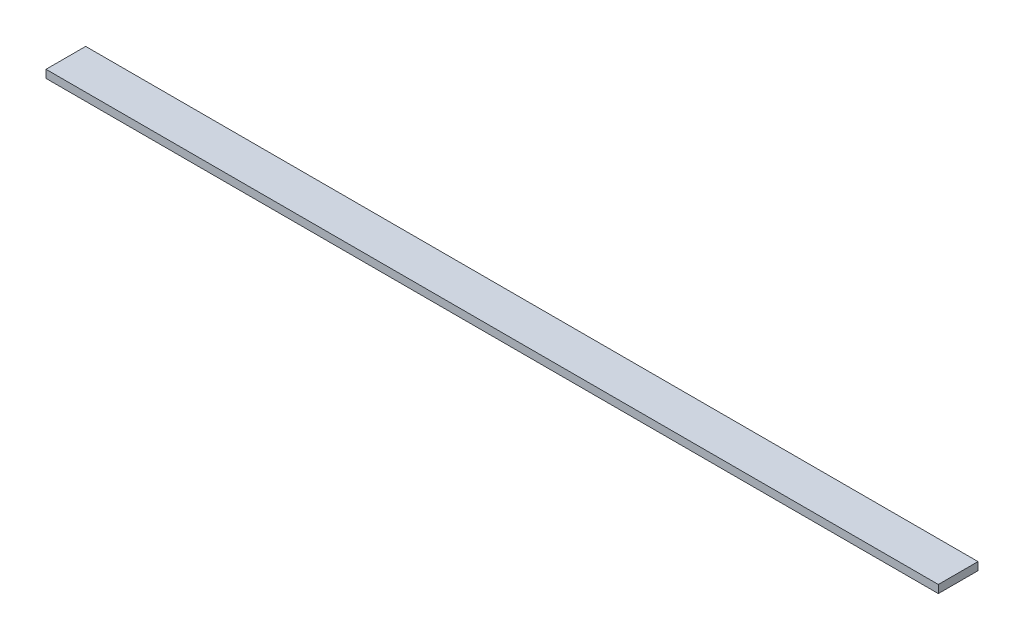
ISO-10303-21;
HEADER;
FILE_DESCRIPTION(('STEP AP214'),'2;1');
FILE_NAME('part.step','',(''),(''),'','','');
FILE_SCHEMA(('AUTOMOTIVE_DESIGN { 1 0 10303 214 1 1 1 1 }'));
ENDSEC;
DATA;
#1=APPLICATION_CONTEXT('core data for automotive mechanical design processes');
#2=APPLICATION_PROTOCOL_DEFINITION('international standard','automotive_design',2000,#1);
#3=PRODUCT_CONTEXT('',#1,'mechanical');
#4=PRODUCT('Part','Part','',(#3));
#5=PRODUCT_RELATED_PRODUCT_CATEGORY('part','',(#4));
#6=PRODUCT_DEFINITION_FORMATION('','',#4);
#7=PRODUCT_DEFINITION_CONTEXT('part definition',#1,'design');
#8=PRODUCT_DEFINITION('design','',#6,#7);
#9=PRODUCT_DEFINITION_SHAPE('','',#8);
#10=(LENGTH_UNIT() NAMED_UNIT(*) SI_UNIT(.MILLI.,.METRE.));
#11=(NAMED_UNIT(*) PLANE_ANGLE_UNIT() SI_UNIT($,.RADIAN.));
#12=(NAMED_UNIT(*) SI_UNIT($,.STERADIAN.) SOLID_ANGLE_UNIT());
#13=UNCERTAINTY_MEASURE_WITH_UNIT(LENGTH_MEASURE(1.E-05),#10,'distance_accuracy_value','');
#14=(GEOMETRIC_REPRESENTATION_CONTEXT(3) GLOBAL_UNCERTAINTY_ASSIGNED_CONTEXT((#13)) GLOBAL_UNIT_ASSIGNED_CONTEXT((#10,
#11,#12)) REPRESENTATION_CONTEXT('',''));
#15=CARTESIAN_POINT('',(0.,0.,0.));
#16=DIRECTION('',(0.,0.,1.));
#17=DIRECTION('',(1.,0.,0.));
#18=AXIS2_PLACEMENT_3D('',#15,#16,#17);
#19=CARTESIAN_POINT('',(450.,-4.,0.));
#20=DIRECTION('',(0.,1.,0.));
#21=DIRECTION('',(0.,0.,1.));
#22=AXIS2_PLACEMENT_3D('',#19,#20,#21);
#23=PLANE('',#22);
#24=DIRECTION('',(0.,0.,-1.));
#25=VECTOR('',#24,1.);
#26=CARTESIAN_POINT('',(0.,-4.,0.));
#27=LINE('',#26,#25);
#28=CARTESIAN_POINT('',(0.,-4.,0.));
#29=VERTEX_POINT('',#28);
#30=CARTESIAN_POINT('',(0.,-4.,-20.));
#31=VERTEX_POINT('',#30);
#32=EDGE_CURVE('E98',#29,#31,#27,.T.);
#33=ORIENTED_EDGE('',*,*,#32,.T.);
#34=DIRECTION('',(-1.,0.,0.));
#35=VECTOR('',#34,1.);
#36=CARTESIAN_POINT('',(450.,-4.,-20.));
#37=LINE('',#36,#35);
#38=CARTESIAN_POINT('',(450.,-4.,-20.));
#39=VERTEX_POINT('',#38);
#40=EDGE_CURVE('E11',#39,#31,#37,.T.);
#41=ORIENTED_EDGE('',*,*,#40,.F.);
#42=DIRECTION('',(0.,0.,-1.));
#43=VECTOR('',#42,1.);
#44=CARTESIAN_POINT('',(450.,-4.,0.));
#45=LINE('',#44,#43);
#46=CARTESIAN_POINT('',(450.,-4.,0.));
#47=VERTEX_POINT('',#46);
#48=EDGE_CURVE('E75',#47,#39,#45,.T.);
#49=ORIENTED_EDGE('',*,*,#48,.F.);
#50=DIRECTION('',(-1.,0.,0.));
#51=VECTOR('',#50,1.);
#52=CARTESIAN_POINT('',(450.,-4.,0.));
#53=LINE('',#52,#51);
#54=EDGE_CURVE('E51',#47,#29,#53,.T.);
#55=ORIENTED_EDGE('',*,*,#54,.T.);
#56=EDGE_LOOP('',(#33,#41,#49,#55));
#57=FACE_BOUND('',#56,.T.);
#58=ADVANCED_FACE('F35',(#57),#23,.F.);
#59=CARTESIAN_POINT('',(450.,0.,-20.));
#60=DIRECTION('',(0.,0.,-1.));
#61=DIRECTION('',(-1.,0.,0.));
#62=AXIS2_PLACEMENT_3D('',#59,#60,#61);
#63=PLANE('',#62);
#64=DIRECTION('',(0.,-1.,0.));
#65=VECTOR('',#64,1.);
#66=CARTESIAN_POINT('',(0.,0.,-20.));
#67=LINE('',#66,#65);
#68=CARTESIAN_POINT('',(0.,0.,-20.));
#69=VERTEX_POINT('',#68);
#70=EDGE_CURVE('E84',#69,#31,#67,.T.);
#71=ORIENTED_EDGE('',*,*,#70,.F.);
#72=DIRECTION('',(-1.,0.,0.));
#73=VECTOR('',#72,1.);
#74=CARTESIAN_POINT('',(450.,0.,-20.));
#75=LINE('',#74,#73);
#76=CARTESIAN_POINT('',(450.,0.,-20.));
#77=VERTEX_POINT('',#76);
#78=EDGE_CURVE('E43',#77,#69,#75,.T.);
#79=ORIENTED_EDGE('',*,*,#78,.F.);
#80=DIRECTION('',(0.,-1.,0.));
#81=VECTOR('',#80,1.);
#82=CARTESIAN_POINT('',(450.,0.,-20.));
#83=LINE('',#82,#81);
#84=EDGE_CURVE('E82',#77,#39,#83,.T.);
#85=ORIENTED_EDGE('',*,*,#84,.T.);
#86=ORIENTED_EDGE('',*,*,#40,.T.);
#87=EDGE_LOOP('',(#71,#79,#85,#86));
#88=FACE_BOUND('',#87,.T.);
#89=ADVANCED_FACE('F81',(#88),#63,.T.);
#90=CARTESIAN_POINT('',(450.,0.,0.));
#91=DIRECTION('',(0.,1.,0.));
#92=DIRECTION('',(0.,0.,1.));
#93=AXIS2_PLACEMENT_3D('',#90,#91,#92);
#94=PLANE('',#93);
#95=DIRECTION('',(0.,0.,-1.));
#96=VECTOR('',#95,1.);
#97=CARTESIAN_POINT('',(0.,0.,0.));
#98=LINE('',#97,#96);
#99=CARTESIAN_POINT('',(0.,0.,0.));
#100=VERTEX_POINT('',#99);
#101=EDGE_CURVE('E101',#100,#69,#98,.T.);
#102=ORIENTED_EDGE('',*,*,#101,.F.);
#103=DIRECTION('',(-1.,0.,0.));
#104=VECTOR('',#103,1.);
#105=CARTESIAN_POINT('',(450.,0.,0.));
#106=LINE('',#105,#104);
#107=CARTESIAN_POINT('',(450.,0.,0.));
#108=VERTEX_POINT('',#107);
#109=EDGE_CURVE('E64',#108,#100,#106,.T.);
#110=ORIENTED_EDGE('',*,*,#109,.F.);
#111=DIRECTION('',(0.,0.,-1.));
#112=VECTOR('',#111,1.);
#113=CARTESIAN_POINT('',(450.,0.,0.));
#114=LINE('',#113,#112);
#115=EDGE_CURVE('E90',#108,#77,#114,.T.);
#116=ORIENTED_EDGE('',*,*,#115,.T.);
#117=ORIENTED_EDGE('',*,*,#78,.T.);
#118=EDGE_LOOP('',(#102,#110,#116,#117));
#119=FACE_BOUND('',#118,.T.);
#120=ADVANCED_FACE('F92',(#119),#94,.T.);
#121=CARTESIAN_POINT('',(450.,-4.,0.));
#122=DIRECTION('',(0.,0.,1.));
#123=DIRECTION('',(1.,0.,0.));
#124=AXIS2_PLACEMENT_3D('',#121,#122,#123);
#125=PLANE('',#124);
#126=DIRECTION('',(0.,1.,0.));
#127=VECTOR('',#126,1.);
#128=CARTESIAN_POINT('',(0.,-4.,0.));
#129=LINE('',#128,#127);
#130=EDGE_CURVE('E103',#29,#100,#129,.T.);
#131=ORIENTED_EDGE('',*,*,#130,.F.);
#132=ORIENTED_EDGE('',*,*,#54,.F.);
#133=DIRECTION('',(0.,1.,0.));
#134=VECTOR('',#133,1.);
#135=CARTESIAN_POINT('',(450.,-4.,0.));
#136=LINE('',#135,#134);
#137=EDGE_CURVE('E93',#47,#108,#136,.T.);
#138=ORIENTED_EDGE('',*,*,#137,.T.);
#139=ORIENTED_EDGE('',*,*,#109,.T.);
#140=EDGE_LOOP('',(#131,#132,#138,#139));
#141=FACE_BOUND('',#140,.T.);
#142=ADVANCED_FACE('F109',(#141),#125,.T.);
#143=CARTESIAN_POINT('',(450.,0.,0.));
#144=DIRECTION('',(-1.,0.,0.));
#145=DIRECTION('',(0.,0.,1.));
#146=AXIS2_PLACEMENT_3D('',#143,#144,#145);
#147=PLANE('',#146);
#148=ORIENTED_EDGE('',*,*,#48,.T.);
#149=ORIENTED_EDGE('',*,*,#84,.F.);
#150=ORIENTED_EDGE('',*,*,#115,.F.);
#151=ORIENTED_EDGE('',*,*,#137,.F.);
#152=EDGE_LOOP('',(#148,#149,#150,#151));
#153=FACE_BOUND('',#152,.T.);
#154=ADVANCED_FACE('F89',(#153),#147,.F.);
#155=CARTESIAN_POINT('',(0.,0.,0.));
#156=DIRECTION('',(-1.,0.,0.));
#157=DIRECTION('',(0.,0.,1.));
#158=AXIS2_PLACEMENT_3D('',#155,#156,#157);
#159=PLANE('',#158);
#160=ORIENTED_EDGE('',*,*,#32,.F.);
#161=ORIENTED_EDGE('',*,*,#130,.T.);
#162=ORIENTED_EDGE('',*,*,#101,.T.);
#163=ORIENTED_EDGE('',*,*,#70,.T.);
#164=EDGE_LOOP('',(#160,#161,#162,#163));
#165=FACE_BOUND('',#164,.T.);
#166=ADVANCED_FACE('F108',(#165),#159,.T.);
#167=CLOSED_SHELL('',(#58,#89,#120,#142,#154,#166));
#168=MANIFOLD_SOLID_BREP('B2',#167);
#169=ADVANCED_BREP_SHAPE_REPRESENTATION('',(#18,#168),#14);
#170=SHAPE_DEFINITION_REPRESENTATION(#9,#169);
ENDSEC;
END-ISO-10303-21;
